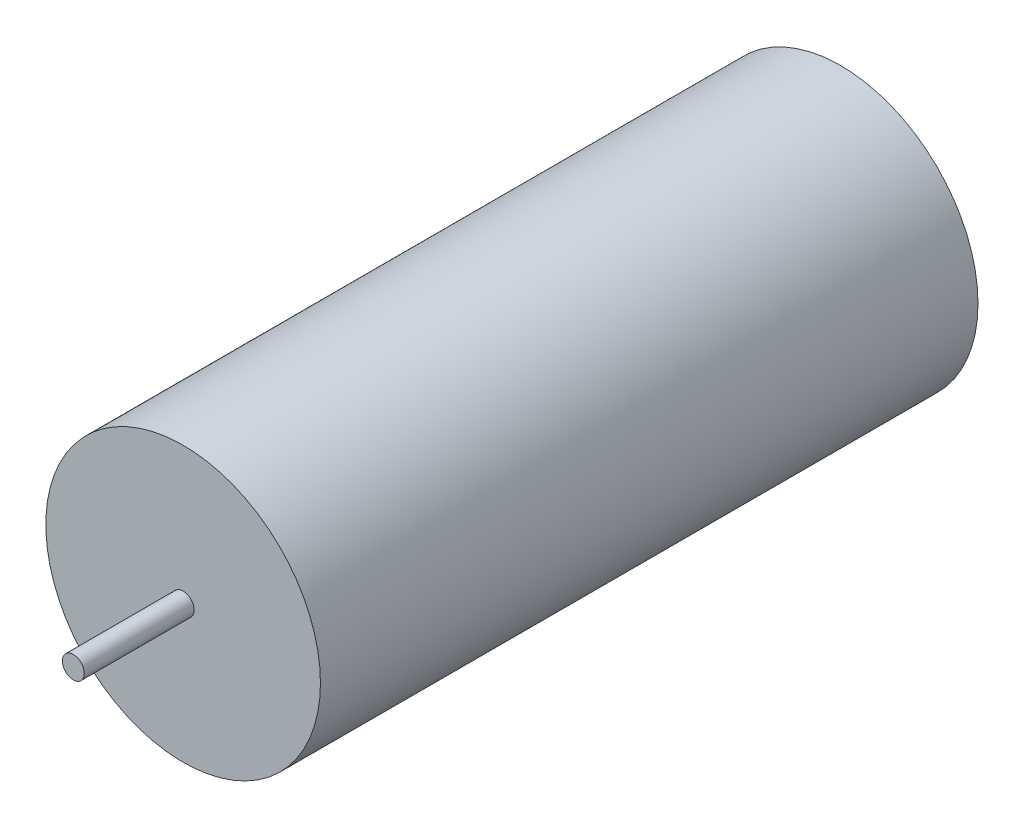
ISO-10303-21;
HEADER;
FILE_DESCRIPTION(('STEP AP214'),'2;1');
FILE_NAME('part.step','',(''),(''),'','','');
FILE_SCHEMA(('AUTOMOTIVE_DESIGN { 1 0 10303 214 1 1 1 1 }'));
ENDSEC;
DATA;
#1=APPLICATION_CONTEXT('core data for automotive mechanical design processes');
#2=APPLICATION_PROTOCOL_DEFINITION('international standard','automotive_design',2000,#1);
#3=PRODUCT_CONTEXT('',#1,'mechanical');
#4=PRODUCT('Part','Part','',(#3));
#5=PRODUCT_RELATED_PRODUCT_CATEGORY('part','',(#4));
#6=PRODUCT_DEFINITION_FORMATION('','',#4);
#7=PRODUCT_DEFINITION_CONTEXT('part definition',#1,'design');
#8=PRODUCT_DEFINITION('design','',#6,#7);
#9=PRODUCT_DEFINITION_SHAPE('','',#8);
#10=(LENGTH_UNIT() NAMED_UNIT(*) SI_UNIT(.MILLI.,.METRE.));
#11=(NAMED_UNIT(*) PLANE_ANGLE_UNIT() SI_UNIT($,.RADIAN.));
#12=(NAMED_UNIT(*) SI_UNIT($,.STERADIAN.) SOLID_ANGLE_UNIT());
#13=UNCERTAINTY_MEASURE_WITH_UNIT(LENGTH_MEASURE(1.E-05),#10,'distance_accuracy_value','');
#14=(GEOMETRIC_REPRESENTATION_CONTEXT(3) GLOBAL_UNCERTAINTY_ASSIGNED_CONTEXT((#13)) GLOBAL_UNIT_ASSIGNED_CONTEXT((#10,
#11,#12)) REPRESENTATION_CONTEXT('',''));
#15=CARTESIAN_POINT('',(0.,0.,0.));
#16=DIRECTION('',(0.,0.,1.));
#17=DIRECTION('',(1.,0.,0.));
#18=AXIS2_PLACEMENT_3D('',#15,#16,#17);
#19=CARTESIAN_POINT('',(0.,0.,59.86));
#20=DIRECTION('',(0.,0.,-1.));
#21=DIRECTION('',(-1.,0.,0.));
#22=AXIS2_PLACEMENT_3D('',#19,#20,#21);
#23=CYLINDRICAL_SURFACE('',#22,12.5);
#24=CARTESIAN_POINT('',(0.,0.,59.86));
#25=DIRECTION('',(0.,0.,1.));
#26=DIRECTION('',(1.,0.,0.));
#27=AXIS2_PLACEMENT_3D('',#24,#25,#26);
#28=CIRCLE('',#27,12.5);
#29=CARTESIAN_POINT('',(12.5,0.,59.86));
#30=VERTEX_POINT('',#29);
#31=EDGE_CURVE('E10',#30,#30,#28,.T.);
#32=ORIENTED_EDGE('',*,*,#31,.F.);
#33=EDGE_LOOP('',(#32));
#34=FACE_BOUND('',#33,.T.);
#35=CARTESIAN_POINT('',(0.,0.,0.));
#36=DIRECTION('',(0.,0.,1.));
#37=DIRECTION('',(1.,0.,0.));
#38=AXIS2_PLACEMENT_3D('',#35,#36,#37);
#39=CIRCLE('',#38,12.5);
#40=CARTESIAN_POINT('',(12.5,0.,0.));
#41=VERTEX_POINT('',#40);
#42=EDGE_CURVE('E37',#41,#41,#39,.T.);
#43=ORIENTED_EDGE('',*,*,#42,.T.);
#44=EDGE_LOOP('',(#43));
#45=FACE_BOUND('',#44,.T.);
#46=ADVANCED_FACE('F34',(#34,#45),#23,.T.);
#47=CARTESIAN_POINT('',(0.,0.,59.86));
#48=DIRECTION('',(0.,0.,1.));
#49=DIRECTION('',(1.,0.,0.));
#50=AXIS2_PLACEMENT_3D('',#47,#48,#49);
#51=PLANE('',#50);
#52=CARTESIAN_POINT('',(0.,0.,59.86));
#53=DIRECTION('',(0.,0.,1.));
#54=DIRECTION('',(1.,0.,0.));
#55=AXIS2_PLACEMENT_3D('',#52,#53,#54);
#56=CIRCLE('',#55,1.);
#57=CARTESIAN_POINT('',(1.,0.,59.86));
#58=VERTEX_POINT('',#57);
#59=EDGE_CURVE('E46',#58,#58,#56,.T.);
#60=ORIENTED_EDGE('',*,*,#59,.F.);
#61=EDGE_LOOP('',(#60));
#62=FACE_BOUND('',#61,.T.);
#63=ORIENTED_EDGE('',*,*,#31,.T.);
#64=EDGE_LOOP('',(#63));
#65=FACE_BOUND('',#64,.T.);
#66=ADVANCED_FACE('F61',(#62,#65),#51,.T.);
#67=CARTESIAN_POINT('',(0.,0.,0.));
#68=DIRECTION('',(0.,0.,1.));
#69=DIRECTION('',(1.,0.,0.));
#70=AXIS2_PLACEMENT_3D('',#67,#68,#69);
#71=PLANE('',#70);
#72=ORIENTED_EDGE('',*,*,#42,.F.);
#73=EDGE_LOOP('',(#72));
#74=FACE_BOUND('',#73,.T.);
#75=ADVANCED_FACE('F57',(#74),#71,.F.);
#76=CARTESIAN_POINT('',(0.,0.,69.86));
#77=DIRECTION('',(0.,0.,-1.));
#78=DIRECTION('',(-1.,0.,0.));
#79=AXIS2_PLACEMENT_3D('',#76,#77,#78);
#80=CYLINDRICAL_SURFACE('',#79,1.);
#81=CARTESIAN_POINT('',(0.,0.,69.86));
#82=DIRECTION('',(0.,0.,1.));
#83=DIRECTION('',(1.,0.,0.));
#84=AXIS2_PLACEMENT_3D('',#81,#82,#83);
#85=CIRCLE('',#84,1.);
#86=CARTESIAN_POINT('',(1.,0.,69.86));
#87=VERTEX_POINT('',#86);
#88=EDGE_CURVE('E44',#87,#87,#85,.T.);
#89=ORIENTED_EDGE('',*,*,#88,.F.);
#90=EDGE_LOOP('',(#89));
#91=FACE_BOUND('',#90,.T.);
#92=ORIENTED_EDGE('',*,*,#59,.T.);
#93=EDGE_LOOP('',(#92));
#94=FACE_BOUND('',#93,.T.);
#95=ADVANCED_FACE('F54',(#91,#94),#80,.T.);
#96=CARTESIAN_POINT('',(0.,0.,69.86));
#97=DIRECTION('',(0.,0.,1.));
#98=DIRECTION('',(1.,0.,0.));
#99=AXIS2_PLACEMENT_3D('',#96,#97,#98);
#100=PLANE('',#99);
#101=ORIENTED_EDGE('',*,*,#88,.T.);
#102=EDGE_LOOP('',(#101));
#103=FACE_BOUND('',#102,.T.);
#104=ADVANCED_FACE('F52',(#103),#100,.T.);
#105=CLOSED_SHELL('',(#46,#66,#75,#95,#104));
#106=MANIFOLD_SOLID_BREP('B2',#105);
#107=ADVANCED_BREP_SHAPE_REPRESENTATION('',(#18,#106),#14);
#108=SHAPE_DEFINITION_REPRESENTATION(#9,#107);
ENDSEC;
END-ISO-10303-21;
